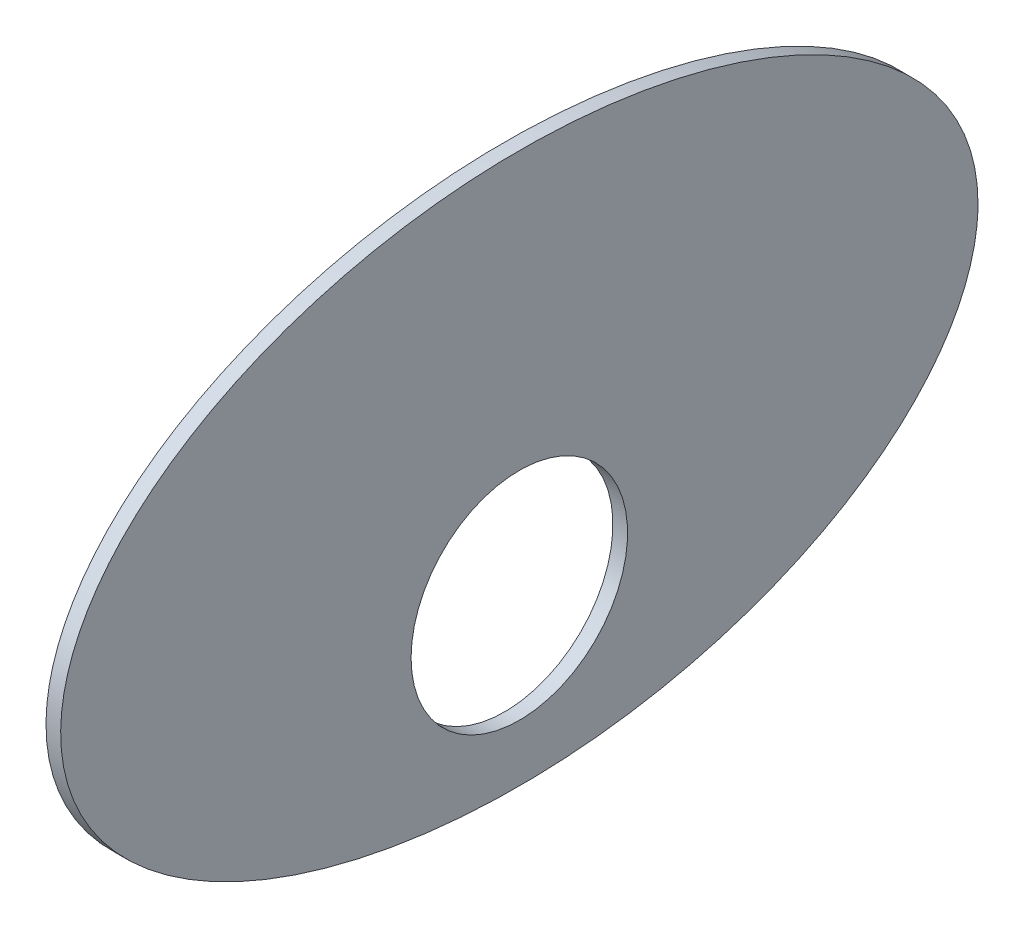
ISO-10303-21;
HEADER;
FILE_DESCRIPTION(('STEP AP214'),'2;1');
FILE_NAME('part.step','',(''),(''),'','','');
FILE_SCHEMA(('AUTOMOTIVE_DESIGN { 1 0 10303 214 1 1 1 1 }'));
ENDSEC;
DATA;
#1=APPLICATION_CONTEXT('core data for automotive mechanical design processes');
#2=APPLICATION_PROTOCOL_DEFINITION('international standard','automotive_design',2000,#1);
#3=PRODUCT_CONTEXT('',#1,'mechanical');
#4=PRODUCT('Part','Part','',(#3));
#5=PRODUCT_RELATED_PRODUCT_CATEGORY('part','',(#4));
#6=PRODUCT_DEFINITION_FORMATION('','',#4);
#7=PRODUCT_DEFINITION_CONTEXT('part definition',#1,'design');
#8=PRODUCT_DEFINITION('design','',#6,#7);
#9=PRODUCT_DEFINITION_SHAPE('','',#8);
#10=(LENGTH_UNIT() NAMED_UNIT(*) SI_UNIT(.MILLI.,.METRE.));
#11=(NAMED_UNIT(*) PLANE_ANGLE_UNIT() SI_UNIT($,.RADIAN.));
#12=(NAMED_UNIT(*) SI_UNIT($,.STERADIAN.) SOLID_ANGLE_UNIT());
#13=UNCERTAINTY_MEASURE_WITH_UNIT(LENGTH_MEASURE(1.E-05),#10,'distance_accuracy_value','');
#14=(GEOMETRIC_REPRESENTATION_CONTEXT(3) GLOBAL_UNCERTAINTY_ASSIGNED_CONTEXT((#13)) GLOBAL_UNIT_ASSIGNED_CONTEXT((#10,
#11,#12)) REPRESENTATION_CONTEXT('',''));
#15=CARTESIAN_POINT('',(0.,0.,0.));
#16=DIRECTION('',(0.,0.,1.));
#17=DIRECTION('',(1.,0.,0.));
#18=AXIS2_PLACEMENT_3D('',#15,#16,#17);
#19=CARTESIAN_POINT('',(4.,0.,0.));
#20=DIRECTION('',(1.,0.,0.));
#21=DIRECTION('',(0.,0.,-1.));
#22=AXIS2_PLACEMENT_3D('',#19,#20,#21);
#23=ELLIPSE('',#22,125.,75.);
#24=DIRECTION('',(-1.,0.,0.));
#25=VECTOR('',#24,1.);
#26=SURFACE_OF_LINEAR_EXTRUSION('',#23,#25);
#27=CARTESIAN_POINT('',(4.,0.,-125.));
#28=VERTEX_POINT('',#27);
#29=EDGE_CURVE('E10',#28,#28,#23,.T.);
#30=ORIENTED_EDGE('',*,*,#29,.F.);
#31=EDGE_LOOP('',(#30));
#32=FACE_BOUND('',#31,.T.);
#33=CARTESIAN_POINT('',(0.,0.,0.));
#34=DIRECTION('',(1.,0.,0.));
#35=DIRECTION('',(0.,0.,-1.));
#36=AXIS2_PLACEMENT_3D('',#33,#34,#35);
#37=ELLIPSE('',#36,125.,75.);
#38=CARTESIAN_POINT('',(0.,0.,-125.));
#39=VERTEX_POINT('',#38);
#40=EDGE_CURVE('E35',#39,#39,#37,.T.);
#41=ORIENTED_EDGE('',*,*,#40,.T.);
#42=EDGE_LOOP('',(#41));
#43=FACE_BOUND('',#42,.T.);
#44=ADVANCED_FACE('F31',(#32,#43),#26,.F.);
#45=CARTESIAN_POINT('',(4.,0.,0.));
#46=DIRECTION('',(1.,0.,0.));
#47=DIRECTION('',(0.,0.,-1.));
#48=AXIS2_PLACEMENT_3D('',#45,#46,#47);
#49=PLANE('',#48);
#50=CARTESIAN_POINT('',(4.,-30.,0.));
#51=DIRECTION('',(-1.,0.,0.));
#52=DIRECTION('',(0.,0.,1.));
#53=AXIS2_PLACEMENT_3D('',#50,#51,#52);
#54=CIRCLE('',#53,29.5);
#55=CARTESIAN_POINT('',(4.,-30.,29.5));
#56=VERTEX_POINT('',#55);
#57=EDGE_CURVE('E41',#56,#56,#54,.T.);
#58=ORIENTED_EDGE('',*,*,#57,.T.);
#59=EDGE_LOOP('',(#58));
#60=FACE_BOUND('',#59,.T.);
#61=ORIENTED_EDGE('',*,*,#29,.T.);
#62=EDGE_LOOP('',(#61));
#63=FACE_BOUND('',#62,.T.);
#64=ADVANCED_FACE('F50',(#60,#63),#49,.T.);
#65=CARTESIAN_POINT('',(0.,0.,0.));
#66=DIRECTION('',(1.,0.,0.));
#67=DIRECTION('',(0.,0.,-1.));
#68=AXIS2_PLACEMENT_3D('',#65,#66,#67);
#69=PLANE('',#68);
#70=CARTESIAN_POINT('',(0.,-30.,0.));
#71=DIRECTION('',(-1.,0.,0.));
#72=DIRECTION('',(0.,0.,1.));
#73=AXIS2_PLACEMENT_3D('',#70,#71,#72);
#74=CIRCLE('',#73,29.5);
#75=CARTESIAN_POINT('',(0.,-30.,29.5));
#76=VERTEX_POINT('',#75);
#77=EDGE_CURVE('E44',#76,#76,#74,.T.);
#78=ORIENTED_EDGE('',*,*,#77,.F.);
#79=EDGE_LOOP('',(#78));
#80=FACE_BOUND('',#79,.T.);
#81=ORIENTED_EDGE('',*,*,#40,.F.);
#82=EDGE_LOOP('',(#81));
#83=FACE_BOUND('',#82,.T.);
#84=ADVANCED_FACE('F55',(#80,#83),#69,.F.);
#85=CARTESIAN_POINT('',(4.,-30.,0.));
#86=DIRECTION('',(-1.,0.,0.));
#87=DIRECTION('',(0.,0.,1.));
#88=AXIS2_PLACEMENT_3D('',#85,#86,#87);
#89=CYLINDRICAL_SURFACE('',#88,29.5);
#90=ORIENTED_EDGE('',*,*,#57,.F.);
#91=EDGE_LOOP('',(#90));
#92=FACE_BOUND('',#91,.T.);
#93=ORIENTED_EDGE('',*,*,#77,.T.);
#94=EDGE_LOOP('',(#93));
#95=FACE_BOUND('',#94,.T.);
#96=ADVANCED_FACE('F52',(#92,#95),#89,.F.);
#97=CLOSED_SHELL('',(#44,#64,#84,#96));
#98=MANIFOLD_SOLID_BREP('B2',#97);
#99=ADVANCED_BREP_SHAPE_REPRESENTATION('',(#18,#98),#14);
#100=SHAPE_DEFINITION_REPRESENTATION(#9,#99);
ENDSEC;
END-ISO-10303-21;
